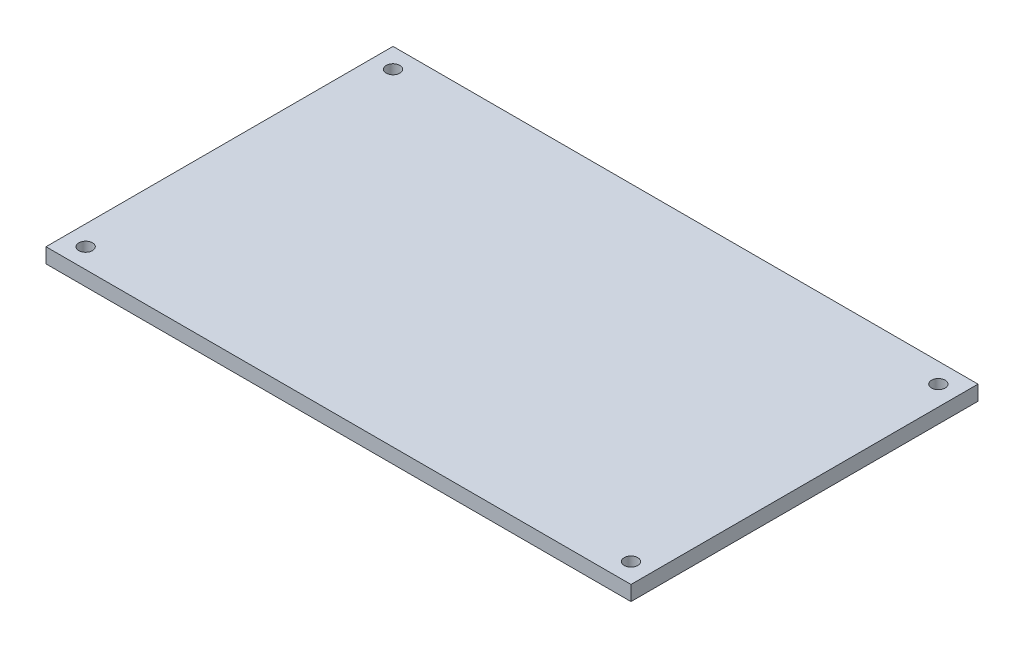
ISO-10303-21;
HEADER;
FILE_DESCRIPTION(('STEP AP214'),'2;1');
FILE_NAME('part.step','',(''),(''),'','','');
FILE_SCHEMA(('AUTOMOTIVE_DESIGN { 1 0 10303 214 1 1 1 1 }'));
ENDSEC;
DATA;
#1=APPLICATION_CONTEXT('core data for automotive mechanical design processes');
#2=APPLICATION_PROTOCOL_DEFINITION('international standard','automotive_design',2000,#1);
#3=PRODUCT_CONTEXT('',#1,'mechanical');
#4=PRODUCT('Part','Part','',(#3));
#5=PRODUCT_RELATED_PRODUCT_CATEGORY('part','',(#4));
#6=PRODUCT_DEFINITION_FORMATION('','',#4);
#7=PRODUCT_DEFINITION_CONTEXT('part definition',#1,'design');
#8=PRODUCT_DEFINITION('design','',#6,#7);
#9=PRODUCT_DEFINITION_SHAPE('','',#8);
#10=(LENGTH_UNIT() NAMED_UNIT(*) SI_UNIT(.MILLI.,.METRE.));
#11=(NAMED_UNIT(*) PLANE_ANGLE_UNIT() SI_UNIT($,.RADIAN.));
#12=(NAMED_UNIT(*) SI_UNIT($,.STERADIAN.) SOLID_ANGLE_UNIT());
#13=UNCERTAINTY_MEASURE_WITH_UNIT(LENGTH_MEASURE(1.E-05),#10,'distance_accuracy_value','');
#14=(GEOMETRIC_REPRESENTATION_CONTEXT(3) GLOBAL_UNCERTAINTY_ASSIGNED_CONTEXT((#13)) GLOBAL_UNIT_ASSIGNED_CONTEXT((#10,
#11,#12)) REPRESENTATION_CONTEXT('',''));
#15=CARTESIAN_POINT('',(0.,0.,0.));
#16=DIRECTION('',(0.,0.,1.));
#17=DIRECTION('',(1.,0.,0.));
#18=AXIS2_PLACEMENT_3D('',#15,#16,#17);
#19=CARTESIAN_POINT('',(0.,3.,0.));
#20=DIRECTION('',(0.,-1.,0.));
#21=DIRECTION('',(0.,0.,-1.));
#22=AXIS2_PLACEMENT_3D('',#19,#20,#21);
#23=PLANE('',#22);
#24=DIRECTION('',(0.,0.,-1.));
#25=VECTOR('',#24,1.);
#26=CARTESIAN_POINT('',(59.,3.,35.));
#27=LINE('',#26,#25);
#28=CARTESIAN_POINT('',(59.,3.,35.));
#29=VERTEX_POINT('',#28);
#30=CARTESIAN_POINT('',(59.,3.,-35.));
#31=VERTEX_POINT('',#30);
#32=EDGE_CURVE('E92',#29,#31,#27,.T.);
#33=ORIENTED_EDGE('',*,*,#32,.T.);
#34=DIRECTION('',(-1.,0.,0.));
#35=VECTOR('',#34,1.);
#36=CARTESIAN_POINT('',(-59.,3.,-35.));
#37=LINE('',#36,#35);
#38=CARTESIAN_POINT('',(-59.,3.,-35.));
#39=VERTEX_POINT('',#38);
#40=EDGE_CURVE('E87',#31,#39,#37,.T.);
#41=ORIENTED_EDGE('',*,*,#40,.T.);
#42=DIRECTION('',(0.,0.,1.));
#43=VECTOR('',#42,1.);
#44=CARTESIAN_POINT('',(-59.,3.,35.));
#45=LINE('',#44,#43);
#46=CARTESIAN_POINT('',(-59.,3.,35.));
#47=VERTEX_POINT('',#46);
#48=EDGE_CURVE('E90',#39,#47,#45,.T.);
#49=ORIENTED_EDGE('',*,*,#48,.T.);
#50=DIRECTION('',(1.,0.,0.));
#51=VECTOR('',#50,1.);
#52=CARTESIAN_POINT('',(-59.,3.,35.));
#53=LINE('',#52,#51);
#54=EDGE_CURVE('E57',#47,#29,#53,.T.);
#55=ORIENTED_EDGE('',*,*,#54,.T.);
#56=EDGE_LOOP('',(#33,#41,#49,#55));
#57=FACE_BOUND('',#56,.T.);
#58=CARTESIAN_POINT('',(-55.,3.,-31.));
#59=DIRECTION('',(0.,1.,0.));
#60=DIRECTION('',(0.,0.,1.));
#61=AXIS2_PLACEMENT_3D('',#58,#59,#60);
#62=CIRCLE('',#61,1.375);
#63=CARTESIAN_POINT('',(-55.,3.,-29.625));
#64=VERTEX_POINT('',#63);
#65=EDGE_CURVE('E112',#64,#64,#62,.T.);
#66=ORIENTED_EDGE('',*,*,#65,.F.);
#67=EDGE_LOOP('',(#66));
#68=FACE_BOUND('',#67,.T.);
#69=CARTESIAN_POINT('',(55.,3.,-31.));
#70=DIRECTION('',(0.,1.,0.));
#71=DIRECTION('',(0.,0.,1.));
#72=AXIS2_PLACEMENT_3D('',#69,#70,#71);
#73=CIRCLE('',#72,1.375);
#74=CARTESIAN_POINT('',(55.,3.,-29.625));
#75=VERTEX_POINT('',#74);
#76=EDGE_CURVE('E134',#75,#75,#73,.T.);
#77=ORIENTED_EDGE('',*,*,#76,.F.);
#78=EDGE_LOOP('',(#77));
#79=FACE_BOUND('',#78,.T.);
#80=CARTESIAN_POINT('',(55.,3.,31.));
#81=DIRECTION('',(0.,1.,0.));
#82=DIRECTION('',(0.,0.,1.));
#83=AXIS2_PLACEMENT_3D('',#80,#81,#82);
#84=CIRCLE('',#83,1.375);
#85=CARTESIAN_POINT('',(55.,3.,32.375));
#86=VERTEX_POINT('',#85);
#87=EDGE_CURVE('E142',#86,#86,#84,.T.);
#88=ORIENTED_EDGE('',*,*,#87,.F.);
#89=EDGE_LOOP('',(#88));
#90=FACE_BOUND('',#89,.T.);
#91=CARTESIAN_POINT('',(-55.,3.,31.));
#92=DIRECTION('',(0.,1.,0.));
#93=DIRECTION('',(0.,0.,1.));
#94=AXIS2_PLACEMENT_3D('',#91,#92,#93);
#95=CIRCLE('',#94,1.375);
#96=CARTESIAN_POINT('',(-55.,3.,32.375));
#97=VERTEX_POINT('',#96);
#98=EDGE_CURVE('E150',#97,#97,#95,.T.);
#99=ORIENTED_EDGE('',*,*,#98,.F.);
#100=EDGE_LOOP('',(#99));
#101=FACE_BOUND('',#100,.T.);
#102=ADVANCED_FACE('F39',(#57,#68,#79,#90,#101),#23,.F.);
#103=CARTESIAN_POINT('',(0.,0.,0.));
#104=DIRECTION('',(0.,-1.,0.));
#105=DIRECTION('',(0.,0.,-1.));
#106=AXIS2_PLACEMENT_3D('',#103,#104,#105);
#107=PLANE('',#106);
#108=CARTESIAN_POINT('',(55.,0.,31.));
#109=DIRECTION('',(0.,1.,0.));
#110=DIRECTION('',(0.,0.,1.));
#111=AXIS2_PLACEMENT_3D('',#108,#109,#110);
#112=CIRCLE('',#111,1.375);
#113=CARTESIAN_POINT('',(55.,0.,32.375));
#114=VERTEX_POINT('',#113);
#115=EDGE_CURVE('E146',#114,#114,#112,.T.);
#116=ORIENTED_EDGE('',*,*,#115,.T.);
#117=EDGE_LOOP('',(#116));
#118=FACE_BOUND('',#117,.T.);
#119=CARTESIAN_POINT('',(-55.,0.,-31.));
#120=DIRECTION('',(0.,1.,0.));
#121=DIRECTION('',(0.,0.,1.));
#122=AXIS2_PLACEMENT_3D('',#119,#120,#121);
#123=CIRCLE('',#122,1.375);
#124=CARTESIAN_POINT('',(-55.,0.,-29.625));
#125=VERTEX_POINT('',#124);
#126=EDGE_CURVE('E130',#125,#125,#123,.T.);
#127=ORIENTED_EDGE('',*,*,#126,.T.);
#128=EDGE_LOOP('',(#127));
#129=FACE_BOUND('',#128,.T.);
#130=DIRECTION('',(0.,0.,-1.));
#131=VECTOR('',#130,1.);
#132=CARTESIAN_POINT('',(59.,0.,35.));
#133=LINE('',#132,#131);
#134=CARTESIAN_POINT('',(59.,0.,35.));
#135=VERTEX_POINT('',#134);
#136=CARTESIAN_POINT('',(59.,0.,-35.));
#137=VERTEX_POINT('',#136);
#138=EDGE_CURVE('E108',#135,#137,#133,.T.);
#139=ORIENTED_EDGE('',*,*,#138,.F.);
#140=DIRECTION('',(1.,0.,0.));
#141=VECTOR('',#140,1.);
#142=CARTESIAN_POINT('',(-59.,0.,35.));
#143=LINE('',#142,#141);
#144=CARTESIAN_POINT('',(-59.,0.,35.));
#145=VERTEX_POINT('',#144);
#146=EDGE_CURVE('E80',#145,#135,#143,.T.);
#147=ORIENTED_EDGE('',*,*,#146,.F.);
#148=DIRECTION('',(0.,0.,1.));
#149=VECTOR('',#148,1.);
#150=CARTESIAN_POINT('',(-59.,0.,35.));
#151=LINE('',#150,#149);
#152=CARTESIAN_POINT('',(-59.,0.,-35.));
#153=VERTEX_POINT('',#152);
#154=EDGE_CURVE('E74',#153,#145,#151,.T.);
#155=ORIENTED_EDGE('',*,*,#154,.F.);
#156=DIRECTION('',(-1.,0.,0.));
#157=VECTOR('',#156,1.);
#158=CARTESIAN_POINT('',(-59.,0.,-35.));
#159=LINE('',#158,#157);
#160=EDGE_CURVE('E97',#137,#153,#159,.T.);
#161=ORIENTED_EDGE('',*,*,#160,.F.);
#162=EDGE_LOOP('',(#139,#147,#155,#161));
#163=FACE_BOUND('',#162,.T.);
#164=CARTESIAN_POINT('',(55.,0.,-31.));
#165=DIRECTION('',(0.,1.,0.));
#166=DIRECTION('',(0.,0.,1.));
#167=AXIS2_PLACEMENT_3D('',#164,#165,#166);
#168=CIRCLE('',#167,1.375);
#169=CARTESIAN_POINT('',(55.,0.,-29.625));
#170=VERTEX_POINT('',#169);
#171=EDGE_CURVE('E138',#170,#170,#168,.T.);
#172=ORIENTED_EDGE('',*,*,#171,.T.);
#173=EDGE_LOOP('',(#172));
#174=FACE_BOUND('',#173,.T.);
#175=CARTESIAN_POINT('',(-55.,0.,31.));
#176=DIRECTION('',(0.,1.,0.));
#177=DIRECTION('',(0.,0.,1.));
#178=AXIS2_PLACEMENT_3D('',#175,#176,#177);
#179=CIRCLE('',#178,1.375);
#180=CARTESIAN_POINT('',(-55.,0.,32.375));
#181=VERTEX_POINT('',#180);
#182=EDGE_CURVE('E154',#181,#181,#179,.T.);
#183=ORIENTED_EDGE('',*,*,#182,.T.);
#184=EDGE_LOOP('',(#183));
#185=FACE_BOUND('',#184,.T.);
#186=ADVANCED_FACE('F125',(#118,#129,#163,#174,#185),#107,.T.);
#187=CARTESIAN_POINT('',(59.,3.,35.));
#188=DIRECTION('',(-1.,0.,0.));
#189=DIRECTION('',(0.,0.,1.));
#190=AXIS2_PLACEMENT_3D('',#187,#188,#189);
#191=PLANE('',#190);
#192=ORIENTED_EDGE('',*,*,#138,.T.);
#193=DIRECTION('',(0.,-1.,0.));
#194=VECTOR('',#193,1.);
#195=CARTESIAN_POINT('',(59.,3.,-35.));
#196=LINE('',#195,#194);
#197=EDGE_CURVE('E11',#31,#137,#196,.T.);
#198=ORIENTED_EDGE('',*,*,#197,.F.);
#199=ORIENTED_EDGE('',*,*,#32,.F.);
#200=DIRECTION('',(0.,-1.,0.));
#201=VECTOR('',#200,1.);
#202=CARTESIAN_POINT('',(59.,3.,35.));
#203=LINE('',#202,#201);
#204=EDGE_CURVE('E104',#29,#135,#203,.T.);
#205=ORIENTED_EDGE('',*,*,#204,.T.);
#206=EDGE_LOOP('',(#192,#198,#199,#205));
#207=FACE_BOUND('',#206,.T.);
#208=ADVANCED_FACE('F41',(#207),#191,.F.);
#209=CARTESIAN_POINT('',(-59.,3.,-35.));
#210=DIRECTION('',(0.,0.,1.));
#211=DIRECTION('',(1.,0.,0.));
#212=AXIS2_PLACEMENT_3D('',#209,#210,#211);
#213=PLANE('',#212);
#214=ORIENTED_EDGE('',*,*,#160,.T.);
#215=DIRECTION('',(0.,-1.,0.));
#216=VECTOR('',#215,1.);
#217=CARTESIAN_POINT('',(-59.,3.,-35.));
#218=LINE('',#217,#216);
#219=EDGE_CURVE('E49',#39,#153,#218,.T.);
#220=ORIENTED_EDGE('',*,*,#219,.F.);
#221=ORIENTED_EDGE('',*,*,#40,.F.);
#222=ORIENTED_EDGE('',*,*,#197,.T.);
#223=EDGE_LOOP('',(#214,#220,#221,#222));
#224=FACE_BOUND('',#223,.T.);
#225=ADVANCED_FACE('F96',(#224),#213,.F.);
#226=CARTESIAN_POINT('',(-59.,3.,35.));
#227=DIRECTION('',(1.,0.,0.));
#228=DIRECTION('',(0.,0.,-1.));
#229=AXIS2_PLACEMENT_3D('',#226,#227,#228);
#230=PLANE('',#229);
#231=ORIENTED_EDGE('',*,*,#154,.T.);
#232=DIRECTION('',(0.,-1.,0.));
#233=VECTOR('',#232,1.);
#234=CARTESIAN_POINT('',(-59.,3.,35.));
#235=LINE('',#234,#233);
#236=EDGE_CURVE('E99',#47,#145,#235,.T.);
#237=ORIENTED_EDGE('',*,*,#236,.F.);
#238=ORIENTED_EDGE('',*,*,#48,.F.);
#239=ORIENTED_EDGE('',*,*,#219,.T.);
#240=EDGE_LOOP('',(#231,#237,#238,#239));
#241=FACE_BOUND('',#240,.T.);
#242=ADVANCED_FACE('F100',(#241),#230,.F.);
#243=CARTESIAN_POINT('',(-59.,3.,35.));
#244=DIRECTION('',(0.,0.,-1.));
#245=DIRECTION('',(-1.,0.,0.));
#246=AXIS2_PLACEMENT_3D('',#243,#244,#245);
#247=PLANE('',#246);
#248=ORIENTED_EDGE('',*,*,#146,.T.);
#249=ORIENTED_EDGE('',*,*,#204,.F.);
#250=ORIENTED_EDGE('',*,*,#54,.F.);
#251=ORIENTED_EDGE('',*,*,#236,.T.);
#252=EDGE_LOOP('',(#248,#249,#250,#251));
#253=FACE_BOUND('',#252,.T.);
#254=ADVANCED_FACE('F122',(#253),#247,.F.);
#255=CARTESIAN_POINT('',(-55.,3.,-31.));
#256=DIRECTION('',(0.,-1.,0.));
#257=DIRECTION('',(0.,0.,-1.));
#258=AXIS2_PLACEMENT_3D('',#255,#256,#257);
#259=CYLINDRICAL_SURFACE('',#258,1.375);
#260=ORIENTED_EDGE('',*,*,#65,.T.);
#261=EDGE_LOOP('',(#260));
#262=FACE_BOUND('',#261,.T.);
#263=ORIENTED_EDGE('',*,*,#126,.F.);
#264=EDGE_LOOP('',(#263));
#265=FACE_BOUND('',#264,.T.);
#266=ADVANCED_FACE('F173',(#262,#265),#259,.F.);
#267=CARTESIAN_POINT('',(55.,3.,-31.));
#268=DIRECTION('',(0.,-1.,0.));
#269=DIRECTION('',(0.,0.,-1.));
#270=AXIS2_PLACEMENT_3D('',#267,#268,#269);
#271=CYLINDRICAL_SURFACE('',#270,1.375);
#272=ORIENTED_EDGE('',*,*,#76,.T.);
#273=EDGE_LOOP('',(#272));
#274=FACE_BOUND('',#273,.T.);
#275=ORIENTED_EDGE('',*,*,#171,.F.);
#276=EDGE_LOOP('',(#275));
#277=FACE_BOUND('',#276,.T.);
#278=ADVANCED_FACE('F219',(#274,#277),#271,.F.);
#279=CARTESIAN_POINT('',(55.,3.,31.));
#280=DIRECTION('',(0.,-1.,0.));
#281=DIRECTION('',(0.,0.,-1.));
#282=AXIS2_PLACEMENT_3D('',#279,#280,#281);
#283=CYLINDRICAL_SURFACE('',#282,1.375);
#284=ORIENTED_EDGE('',*,*,#87,.T.);
#285=EDGE_LOOP('',(#284));
#286=FACE_BOUND('',#285,.T.);
#287=ORIENTED_EDGE('',*,*,#115,.F.);
#288=EDGE_LOOP('',(#287));
#289=FACE_BOUND('',#288,.T.);
#290=ADVANCED_FACE('F227',(#286,#289),#283,.F.);
#291=CARTESIAN_POINT('',(-55.,3.,31.));
#292=DIRECTION('',(0.,-1.,0.));
#293=DIRECTION('',(0.,0.,-1.));
#294=AXIS2_PLACEMENT_3D('',#291,#292,#293);
#295=CYLINDRICAL_SURFACE('',#294,1.375);
#296=ORIENTED_EDGE('',*,*,#98,.T.);
#297=EDGE_LOOP('',(#296));
#298=FACE_BOUND('',#297,.T.);
#299=ORIENTED_EDGE('',*,*,#182,.F.);
#300=EDGE_LOOP('',(#299));
#301=FACE_BOUND('',#300,.T.);
#302=ADVANCED_FACE('F162',(#298,#301),#295,.F.);
#303=CLOSED_SHELL('',(#102,#186,#208,#225,#242,#254,#266,#278,#290,#302));
#304=MANIFOLD_SOLID_BREP('B2',#303);
#305=ADVANCED_BREP_SHAPE_REPRESENTATION('',(#18,#304),#14);
#306=SHAPE_DEFINITION_REPRESENTATION(#9,#305);
ENDSEC;
END-ISO-10303-21;
